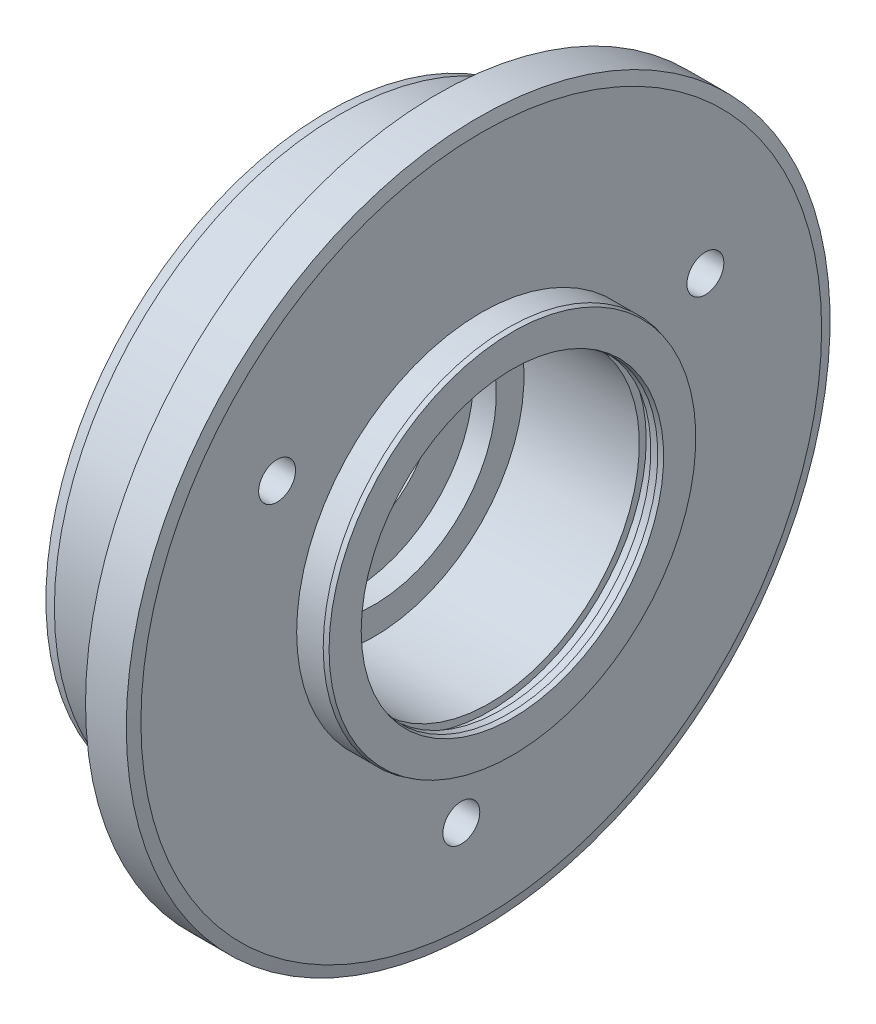
ISO-10303-21;
HEADER;
FILE_DESCRIPTION(('STEP AP214'),'2;1');
FILE_NAME('part.step','',(''),(''),'','','');
FILE_SCHEMA(('AUTOMOTIVE_DESIGN { 1 0 10303 214 1 1 1 1 }'));
ENDSEC;
DATA;
#1=APPLICATION_CONTEXT('core data for automotive mechanical design processes');
#2=APPLICATION_PROTOCOL_DEFINITION('international standard','automotive_design',2000,#1);
#3=PRODUCT_CONTEXT('',#1,'mechanical');
#4=PRODUCT('Part','Part','',(#3));
#5=PRODUCT_RELATED_PRODUCT_CATEGORY('part','',(#4));
#6=PRODUCT_DEFINITION_FORMATION('','',#4);
#7=PRODUCT_DEFINITION_CONTEXT('part definition',#1,'design');
#8=PRODUCT_DEFINITION('design','',#6,#7);
#9=PRODUCT_DEFINITION_SHAPE('','',#8);
#10=(LENGTH_UNIT() NAMED_UNIT(*) SI_UNIT(.MILLI.,.METRE.));
#11=(NAMED_UNIT(*) PLANE_ANGLE_UNIT() SI_UNIT($,.RADIAN.));
#12=(NAMED_UNIT(*) SI_UNIT($,.STERADIAN.) SOLID_ANGLE_UNIT());
#13=UNCERTAINTY_MEASURE_WITH_UNIT(LENGTH_MEASURE(1.E-05),#10,'distance_accuracy_value','');
#14=(GEOMETRIC_REPRESENTATION_CONTEXT(3) GLOBAL_UNCERTAINTY_ASSIGNED_CONTEXT((#13)) GLOBAL_UNIT_ASSIGNED_CONTEXT((#10,
#11,#12)) REPRESENTATION_CONTEXT('',''));
#15=CARTESIAN_POINT('',(0.,0.,0.));
#16=DIRECTION('',(0.,0.,1.));
#17=DIRECTION('',(1.,0.,0.));
#18=AXIS2_PLACEMENT_3D('',#15,#16,#17);
#19=CARTESIAN_POINT('',(0.,0.,0.));
#20=DIRECTION('',(-1.,0.,0.));
#21=DIRECTION('',(0.,0.,1.));
#22=AXIS2_PLACEMENT_3D('',#19,#20,#21);
#23=CYLINDRICAL_SURFACE('',#22,12.35);
#24=CARTESIAN_POINT('',(0.500000000000001,0.,0.));
#25=DIRECTION('',(1.,0.,0.));
#26=DIRECTION('',(0.,0.,-1.));
#27=AXIS2_PLACEMENT_3D('',#24,#25,#26);
#28=CIRCLE('',#27,12.35);
#29=CARTESIAN_POINT('',(0.500000000000001,0.,-12.35));
#30=VERTEX_POINT('',#29);
#31=EDGE_CURVE('E11',#30,#30,#28,.T.);
#32=ORIENTED_EDGE('',*,*,#31,.T.);
#33=EDGE_LOOP('',(#32));
#34=FACE_BOUND('',#33,.T.);
#35=CARTESIAN_POINT('',(4.75,0.,0.));
#36=DIRECTION('',(-1.,0.,0.));
#37=DIRECTION('',(0.,0.,1.));
#38=AXIS2_PLACEMENT_3D('',#35,#36,#37);
#39=CIRCLE('',#38,12.35);
#40=CARTESIAN_POINT('',(4.75,0.,12.35));
#41=VERTEX_POINT('',#40);
#42=EDGE_CURVE('E80',#41,#41,#39,.T.);
#43=ORIENTED_EDGE('',*,*,#42,.T.);
#44=EDGE_LOOP('',(#43));
#45=FACE_BOUND('',#44,.T.);
#46=ADVANCED_FACE('F37',(#34,#45),#23,.T.);
#47=CARTESIAN_POINT('',(0.,3.5,0.));
#48=DIRECTION('',(1.,0.,0.));
#49=DIRECTION('',(0.,0.,-1.));
#50=AXIS2_PLACEMENT_3D('',#47,#48,#49);
#51=PLANE('',#50);
#52=CARTESIAN_POINT('',(0.,0.,0.));
#53=DIRECTION('',(1.,0.,0.));
#54=DIRECTION('',(0.,0.,-1.));
#55=AXIS2_PLACEMENT_3D('',#52,#53,#54);
#56=CIRCLE('',#55,12.2160254037844);
#57=CARTESIAN_POINT('',(0.,0.,-12.2160254037844));
#58=VERTEX_POINT('',#57);
#59=EDGE_CURVE('E44',#58,#58,#56,.F.);
#60=ORIENTED_EDGE('',*,*,#59,.T.);
#61=EDGE_LOOP('',(#60));
#62=FACE_BOUND('',#61,.T.);
#63=CARTESIAN_POINT('',(0.,0.,0.));
#64=DIRECTION('',(-1.,0.,0.));
#65=DIRECTION('',(0.,0.,1.));
#66=AXIS2_PLACEMENT_3D('',#63,#64,#65);
#67=CIRCLE('',#66,3.5);
#68=CARTESIAN_POINT('',(0.,0.,3.5));
#69=VERTEX_POINT('',#68);
#70=EDGE_CURVE('E113',#69,#69,#67,.T.);
#71=ORIENTED_EDGE('',*,*,#70,.F.);
#72=EDGE_LOOP('',(#71));
#73=FACE_BOUND('',#72,.T.);
#74=ADVANCED_FACE('F136',(#62,#73),#51,.F.);
#75=CARTESIAN_POINT('',(0.,0.,0.));
#76=DIRECTION('',(-1.,0.,0.));
#77=DIRECTION('',(0.,0.,1.));
#78=AXIS2_PLACEMENT_3D('',#75,#76,#77);
#79=CYLINDRICAL_SURFACE('',#78,3.5);
#80=CARTESIAN_POINT('',(1.,0.,0.));
#81=DIRECTION('',(-1.,0.,0.));
#82=DIRECTION('',(0.,0.,1.));
#83=AXIS2_PLACEMENT_3D('',#80,#81,#82);
#84=CIRCLE('',#83,3.5);
#85=CARTESIAN_POINT('',(1.,0.,3.5));
#86=VERTEX_POINT('',#85);
#87=EDGE_CURVE('E110',#86,#86,#84,.T.);
#88=ORIENTED_EDGE('',*,*,#87,.F.);
#89=EDGE_LOOP('',(#88));
#90=FACE_BOUND('',#89,.T.);
#91=ORIENTED_EDGE('',*,*,#70,.T.);
#92=EDGE_LOOP('',(#91));
#93=FACE_BOUND('',#92,.T.);
#94=ADVANCED_FACE('F161',(#90,#93),#79,.F.);
#95=CARTESIAN_POINT('',(1.,5.305,0.));
#96=DIRECTION('',(-1.,0.,0.));
#97=DIRECTION('',(0.,0.,1.));
#98=AXIS2_PLACEMENT_3D('',#95,#96,#97);
#99=PLANE('',#98);
#100=CARTESIAN_POINT('',(1.,0.,0.));
#101=DIRECTION('',(-1.,0.,0.));
#102=DIRECTION('',(0.,0.,1.));
#103=AXIS2_PLACEMENT_3D('',#100,#101,#102);
#104=CIRCLE('',#103,5.305);
#105=CARTESIAN_POINT('',(1.,0.,5.305));
#106=VERTEX_POINT('',#105);
#107=EDGE_CURVE('E107',#106,#106,#104,.T.);
#108=ORIENTED_EDGE('',*,*,#107,.F.);
#109=EDGE_LOOP('',(#108));
#110=FACE_BOUND('',#109,.T.);
#111=ORIENTED_EDGE('',*,*,#87,.T.);
#112=EDGE_LOOP('',(#111));
#113=FACE_BOUND('',#112,.T.);
#114=ADVANCED_FACE('F219',(#110,#113),#99,.F.);
#115=CARTESIAN_POINT('',(0.,0.,0.));
#116=DIRECTION('',(-1.,0.,0.));
#117=DIRECTION('',(0.,0.,1.));
#118=AXIS2_PLACEMENT_3D('',#115,#116,#117);
#119=CYLINDRICAL_SURFACE('',#118,5.305);
#120=CARTESIAN_POINT('',(2.,0.,0.));
#121=DIRECTION('',(-1.,0.,0.));
#122=DIRECTION('',(0.,0.,1.));
#123=AXIS2_PLACEMENT_3D('',#120,#121,#122);
#124=CIRCLE('',#123,5.305);
#125=CARTESIAN_POINT('',(2.,0.,5.305));
#126=VERTEX_POINT('',#125);
#127=EDGE_CURVE('E104',#126,#126,#124,.T.);
#128=ORIENTED_EDGE('',*,*,#127,.F.);
#129=EDGE_LOOP('',(#128));
#130=FACE_BOUND('',#129,.T.);
#131=ORIENTED_EDGE('',*,*,#107,.T.);
#132=EDGE_LOOP('',(#131));
#133=FACE_BOUND('',#132,.T.);
#134=ADVANCED_FACE('F215',(#130,#133),#119,.F.);
#135=CARTESIAN_POINT('',(2.,6.5,0.));
#136=DIRECTION('',(-1.,0.,0.));
#137=DIRECTION('',(0.,0.,1.));
#138=AXIS2_PLACEMENT_3D('',#135,#136,#137);
#139=PLANE('',#138);
#140=CARTESIAN_POINT('',(2.,0.,0.));
#141=DIRECTION('',(-1.,0.,0.));
#142=DIRECTION('',(0.,0.,1.));
#143=AXIS2_PLACEMENT_3D('',#140,#141,#142);
#144=CIRCLE('',#143,6.5);
#145=CARTESIAN_POINT('',(2.,0.,6.5));
#146=VERTEX_POINT('',#145);
#147=EDGE_CURVE('E101',#146,#146,#144,.T.);
#148=ORIENTED_EDGE('',*,*,#147,.F.);
#149=EDGE_LOOP('',(#148));
#150=FACE_BOUND('',#149,.T.);
#151=ORIENTED_EDGE('',*,*,#127,.T.);
#152=EDGE_LOOP('',(#151));
#153=FACE_BOUND('',#152,.T.);
#154=ADVANCED_FACE('F211',(#150,#153),#139,.F.);
#155=CARTESIAN_POINT('',(0.,0.,0.));
#156=DIRECTION('',(-1.,0.,0.));
#157=DIRECTION('',(0.,0.,1.));
#158=AXIS2_PLACEMENT_3D('',#155,#156,#157);
#159=CYLINDRICAL_SURFACE('',#158,6.5);
#160=CARTESIAN_POINT('',(7.,0.,0.));
#161=DIRECTION('',(-1.,0.,0.));
#162=DIRECTION('',(0.,0.,1.));
#163=AXIS2_PLACEMENT_3D('',#160,#161,#162);
#164=CIRCLE('',#163,6.5);
#165=CARTESIAN_POINT('',(7.,0.,6.5));
#166=VERTEX_POINT('',#165);
#167=EDGE_CURVE('E98',#166,#166,#164,.T.);
#168=ORIENTED_EDGE('',*,*,#167,.F.);
#169=EDGE_LOOP('',(#168));
#170=FACE_BOUND('',#169,.T.);
#171=ORIENTED_EDGE('',*,*,#147,.T.);
#172=EDGE_LOOP('',(#171));
#173=FACE_BOUND('',#172,.T.);
#174=ADVANCED_FACE('F207',(#170,#173),#159,.F.);
#175=CARTESIAN_POINT('',(7.,6.8,0.));
#176=DIRECTION('',(-1.,0.,0.));
#177=DIRECTION('',(0.,0.,1.));
#178=AXIS2_PLACEMENT_3D('',#175,#176,#177);
#179=PLANE('',#178);
#180=CARTESIAN_POINT('',(7.,0.,0.));
#181=DIRECTION('',(-1.,0.,0.));
#182=DIRECTION('',(0.,0.,1.));
#183=AXIS2_PLACEMENT_3D('',#180,#181,#182);
#184=CIRCLE('',#183,6.8);
#185=CARTESIAN_POINT('',(7.,0.,6.8));
#186=VERTEX_POINT('',#185);
#187=EDGE_CURVE('E95',#186,#186,#184,.T.);
#188=ORIENTED_EDGE('',*,*,#187,.F.);
#189=EDGE_LOOP('',(#188));
#190=FACE_BOUND('',#189,.T.);
#191=ORIENTED_EDGE('',*,*,#167,.T.);
#192=EDGE_LOOP('',(#191));
#193=FACE_BOUND('',#192,.T.);
#194=ADVANCED_FACE('F203',(#190,#193),#179,.F.);
#195=CARTESIAN_POINT('',(0.,0.,0.));
#196=DIRECTION('',(-1.,0.,0.));
#197=DIRECTION('',(0.,0.,1.));
#198=AXIS2_PLACEMENT_3D('',#195,#196,#197);
#199=CYLINDRICAL_SURFACE('',#198,6.8);
#200=CARTESIAN_POINT('',(7.5,0.,0.));
#201=DIRECTION('',(-1.,0.,0.));
#202=DIRECTION('',(0.,0.,1.));
#203=AXIS2_PLACEMENT_3D('',#200,#201,#202);
#204=CIRCLE('',#203,6.8);
#205=CARTESIAN_POINT('',(7.5,0.,6.8));
#206=VERTEX_POINT('',#205);
#207=EDGE_CURVE('E92',#206,#206,#204,.T.);
#208=ORIENTED_EDGE('',*,*,#207,.F.);
#209=EDGE_LOOP('',(#208));
#210=FACE_BOUND('',#209,.T.);
#211=ORIENTED_EDGE('',*,*,#187,.T.);
#212=EDGE_LOOP('',(#211));
#213=FACE_BOUND('',#212,.T.);
#214=ADVANCED_FACE('F199',(#210,#213),#199,.F.);
#215=CARTESIAN_POINT('',(7.5,6.5,0.));
#216=DIRECTION('',(1.,0.,0.));
#217=DIRECTION('',(0.,0.,-1.));
#218=AXIS2_PLACEMENT_3D('',#215,#216,#217);
#219=PLANE('',#218);
#220=CARTESIAN_POINT('',(7.5,0.,0.));
#221=DIRECTION('',(-1.,0.,0.));
#222=DIRECTION('',(0.,0.,1.));
#223=AXIS2_PLACEMENT_3D('',#220,#221,#222);
#224=CIRCLE('',#223,6.5);
#225=CARTESIAN_POINT('',(7.5,0.,6.5));
#226=VERTEX_POINT('',#225);
#227=EDGE_CURVE('E89',#226,#226,#224,.T.);
#228=ORIENTED_EDGE('',*,*,#227,.F.);
#229=EDGE_LOOP('',(#228));
#230=FACE_BOUND('',#229,.T.);
#231=ORIENTED_EDGE('',*,*,#207,.T.);
#232=EDGE_LOOP('',(#231));
#233=FACE_BOUND('',#232,.T.);
#234=ADVANCED_FACE('F195',(#230,#233),#219,.F.);
#235=CARTESIAN_POINT('',(0.,0.,0.));
#236=DIRECTION('',(-1.,0.,0.));
#237=DIRECTION('',(0.,0.,1.));
#238=AXIS2_PLACEMENT_3D('',#235,#236,#237);
#239=CYLINDRICAL_SURFACE('',#238,6.5);
#240=CARTESIAN_POINT('',(7.8,0.,0.));
#241=DIRECTION('',(-1.,0.,0.));
#242=DIRECTION('',(0.,0.,1.));
#243=AXIS2_PLACEMENT_3D('',#240,#241,#242);
#244=CIRCLE('',#243,6.5);
#245=CARTESIAN_POINT('',(7.8,0.,6.5));
#246=VERTEX_POINT('',#245);
#247=EDGE_CURVE('E131',#246,#246,#244,.F.);
#248=ORIENTED_EDGE('',*,*,#247,.T.);
#249=EDGE_LOOP('',(#248));
#250=FACE_BOUND('',#249,.T.);
#251=ORIENTED_EDGE('',*,*,#227,.T.);
#252=EDGE_LOOP('',(#251));
#253=FACE_BOUND('',#252,.T.);
#254=ADVANCED_FACE('F191',(#250,#253),#239,.F.);
#255=CARTESIAN_POINT('',(8.,8.,0.));
#256=DIRECTION('',(-1.,0.,0.));
#257=DIRECTION('',(0.,0.,1.));
#258=AXIS2_PLACEMENT_3D('',#255,#256,#257);
#259=PLANE('',#258);
#260=CARTESIAN_POINT('',(8.,0.,0.));
#261=DIRECTION('',(-1.,0.,0.));
#262=DIRECTION('',(0.,0.,1.));
#263=AXIS2_PLACEMENT_3D('',#260,#261,#262);
#264=CIRCLE('',#263,7.94641016151377);
#265=CARTESIAN_POINT('',(8.,0.,7.94641016151377));
#266=VERTEX_POINT('',#265);
#267=EDGE_CURVE('E128',#266,#266,#264,.F.);
#268=ORIENTED_EDGE('',*,*,#267,.T.);
#269=EDGE_LOOP('',(#268));
#270=FACE_BOUND('',#269,.T.);
#271=CARTESIAN_POINT('',(8.,0.,0.));
#272=DIRECTION('',(-1.,0.,0.));
#273=DIRECTION('',(0.,0.,1.));
#274=AXIS2_PLACEMENT_3D('',#271,#272,#273);
#275=CIRCLE('',#274,6.55358983848623);
#276=CARTESIAN_POINT('',(8.,0.,6.55358983848623));
#277=VERTEX_POINT('',#276);
#278=EDGE_CURVE('E125',#277,#277,#275,.T.);
#279=ORIENTED_EDGE('',*,*,#278,.T.);
#280=EDGE_LOOP('',(#279));
#281=FACE_BOUND('',#280,.T.);
#282=ADVANCED_FACE('F187',(#270,#281),#259,.F.);
#283=CARTESIAN_POINT('',(0.,0.,0.));
#284=DIRECTION('',(-1.,0.,0.));
#285=DIRECTION('',(0.,0.,1.));
#286=AXIS2_PLACEMENT_3D('',#283,#284,#285);
#287=CYLINDRICAL_SURFACE('',#286,8.);
#288=CARTESIAN_POINT('',(7.8,0.,0.));
#289=DIRECTION('',(-1.,0.,0.));
#290=DIRECTION('',(0.,0.,1.));
#291=AXIS2_PLACEMENT_3D('',#288,#289,#290);
#292=CIRCLE('',#291,8.);
#293=CARTESIAN_POINT('',(7.8,0.,8.));
#294=VERTEX_POINT('',#293);
#295=EDGE_CURVE('E122',#294,#294,#292,.T.);
#296=ORIENTED_EDGE('',*,*,#295,.T.);
#297=EDGE_LOOP('',(#296));
#298=FACE_BOUND('',#297,.T.);
#299=CARTESIAN_POINT('',(6.65000000000001,0.,0.));
#300=DIRECTION('',(-1.,0.,0.));
#301=DIRECTION('',(0.,0.,1.));
#302=AXIS2_PLACEMENT_3D('',#299,#300,#301);
#303=CIRCLE('',#302,8.);
#304=CARTESIAN_POINT('',(6.65000000000001,0.,8.));
#305=VERTEX_POINT('',#304);
#306=EDGE_CURVE('E86',#305,#305,#303,.T.);
#307=ORIENTED_EDGE('',*,*,#306,.F.);
#308=EDGE_LOOP('',(#307));
#309=FACE_BOUND('',#308,.T.);
#310=ADVANCED_FACE('F180',(#298,#309),#287,.T.);
#311=CARTESIAN_POINT('',(6.65,15.25,0.));
#312=DIRECTION('',(-1.,0.,0.));
#313=DIRECTION('',(0.,0.,1.));
#314=AXIS2_PLACEMENT_3D('',#311,#312,#313);
#315=PLANE('',#314);
#316=CARTESIAN_POINT('',(6.65,-10.7151904779963,0.864403274089921));
#317=DIRECTION('',(1.,0.,0.));
#318=DIRECTION('',(0.,0.,-1.));
#319=AXIS2_PLACEMENT_3D('',#316,#317,#318);
#320=CIRCLE('',#319,0.799999999999995);
#321=CARTESIAN_POINT('',(6.65,-10.7151904779963,0.0644032740899263));
#322=VERTEX_POINT('',#321);
#323=EDGE_CURVE('E63',#322,#322,#320,.T.);
#324=ORIENTED_EDGE('',*,*,#323,.F.);
#325=EDGE_LOOP('',(#324));
#326=FACE_BOUND('',#325,.T.);
#327=CARTESIAN_POINT('',(6.65,6.10619043347451,8.84742552328893));
#328=DIRECTION('',(1.,0.,0.));
#329=DIRECTION('',(0.,0.,-1.));
#330=AXIS2_PLACEMENT_3D('',#327,#328,#329);
#331=CIRCLE('',#330,0.799999999999995);
#332=CARTESIAN_POINT('',(6.65,6.10619043347451,8.04742552328893));
#333=VERTEX_POINT('',#332);
#334=EDGE_CURVE('E71',#333,#333,#331,.T.);
#335=ORIENTED_EDGE('',*,*,#334,.F.);
#336=EDGE_LOOP('',(#335));
#337=FACE_BOUND('',#336,.T.);
#338=CARTESIAN_POINT('',(6.65,4.60900004452175,-9.71182879737892));
#339=DIRECTION('',(1.,0.,0.));
#340=DIRECTION('',(0.,0.,-1.));
#341=AXIS2_PLACEMENT_3D('',#338,#339,#340);
#342=CIRCLE('',#341,0.799999999999996);
#343=CARTESIAN_POINT('',(6.65,4.60900004452175,-10.5118287973789));
#344=VERTEX_POINT('',#343);
#345=EDGE_CURVE('E77',#344,#344,#342,.T.);
#346=ORIENTED_EDGE('',*,*,#345,.F.);
#347=EDGE_LOOP('',(#346));
#348=FACE_BOUND('',#347,.T.);
#349=CARTESIAN_POINT('',(6.65,0.,0.));
#350=DIRECTION('',(-1.,0.,0.));
#351=DIRECTION('',(0.,0.,1.));
#352=AXIS2_PLACEMENT_3D('',#349,#350,#351);
#353=CIRCLE('',#352,14.75);
#354=CARTESIAN_POINT('',(6.65,0.,14.75));
#355=VERTEX_POINT('',#354);
#356=EDGE_CURVE('E119',#355,#355,#353,.F.);
#357=ORIENTED_EDGE('',*,*,#356,.T.);
#358=EDGE_LOOP('',(#357));
#359=FACE_BOUND('',#358,.T.);
#360=ORIENTED_EDGE('',*,*,#306,.T.);
#361=EDGE_LOOP('',(#360));
#362=FACE_BOUND('',#361,.T.);
#363=ADVANCED_FACE('F174',(#326,#337,#348,#359,#362),#315,.F.);
#364=CARTESIAN_POINT('',(0.,0.,0.));
#365=DIRECTION('',(-1.,0.,0.));
#366=DIRECTION('',(0.,0.,1.));
#367=AXIS2_PLACEMENT_3D('',#364,#365,#366);
#368=CYLINDRICAL_SURFACE('',#367,15.25);
#369=CARTESIAN_POINT('',(6.51602540378444,0.,0.));
#370=DIRECTION('',(-1.,0.,0.));
#371=DIRECTION('',(0.,0.,1.));
#372=AXIS2_PLACEMENT_3D('',#369,#370,#371);
#373=CIRCLE('',#372,15.25);
#374=CARTESIAN_POINT('',(6.51602540378444,0.,15.25));
#375=VERTEX_POINT('',#374);
#376=EDGE_CURVE('E116',#375,#375,#373,.T.);
#377=ORIENTED_EDGE('',*,*,#376,.T.);
#378=EDGE_LOOP('',(#377));
#379=FACE_BOUND('',#378,.T.);
#380=CARTESIAN_POINT('',(4.75,0.,0.));
#381=DIRECTION('',(-1.,0.,0.));
#382=DIRECTION('',(0.,0.,1.));
#383=AXIS2_PLACEMENT_3D('',#380,#381,#382);
#384=CIRCLE('',#383,15.25);
#385=CARTESIAN_POINT('',(4.75,0.,15.25));
#386=VERTEX_POINT('',#385);
#387=EDGE_CURVE('E83',#386,#386,#384,.T.);
#388=ORIENTED_EDGE('',*,*,#387,.F.);
#389=EDGE_LOOP('',(#388));
#390=FACE_BOUND('',#389,.T.);
#391=ADVANCED_FACE('F169',(#379,#390),#368,.T.);
#392=CARTESIAN_POINT('',(4.75,12.35,0.));
#393=DIRECTION('',(1.,0.,0.));
#394=DIRECTION('',(0.,0.,-1.));
#395=AXIS2_PLACEMENT_3D('',#392,#393,#394);
#396=PLANE('',#395);
#397=ORIENTED_EDGE('',*,*,#42,.F.);
#398=EDGE_LOOP('',(#397));
#399=FACE_BOUND('',#398,.T.);
#400=ORIENTED_EDGE('',*,*,#387,.T.);
#401=EDGE_LOOP('',(#400));
#402=FACE_BOUND('',#401,.T.);
#403=ADVANCED_FACE('F165',(#399,#402),#396,.F.);
#404=CARTESIAN_POINT('',(6.51602540378444,0.,0.));
#405=DIRECTION('',(-1.,0.,0.));
#406=DIRECTION('',(0.,0.,1.));
#407=AXIS2_PLACEMENT_3D('',#404,#405,#406);
#408=CONICAL_SURFACE('',#407,15.25,1.30899693899575);
#409=ORIENTED_EDGE('',*,*,#356,.F.);
#410=EDGE_LOOP('',(#409));
#411=FACE_BOUND('',#410,.T.);
#412=ORIENTED_EDGE('',*,*,#376,.F.);
#413=EDGE_LOOP('',(#412));
#414=FACE_BOUND('',#413,.T.);
#415=ADVANCED_FACE('F168',(#411,#414),#408,.T.);
#416=CARTESIAN_POINT('',(7.8,0.,0.));
#417=DIRECTION('',(-1.,0.,0.));
#418=DIRECTION('',(0.,0.,1.));
#419=AXIS2_PLACEMENT_3D('',#416,#417,#418);
#420=CONICAL_SURFACE('',#419,8.,0.261799387799157);
#421=ORIENTED_EDGE('',*,*,#267,.F.);
#422=EDGE_LOOP('',(#421));
#423=FACE_BOUND('',#422,.T.);
#424=ORIENTED_EDGE('',*,*,#295,.F.);
#425=EDGE_LOOP('',(#424));
#426=FACE_BOUND('',#425,.T.);
#427=ADVANCED_FACE('F152',(#423,#426),#420,.T.);
#428=CARTESIAN_POINT('',(8.,0.,0.));
#429=DIRECTION('',(1.,0.,0.));
#430=DIRECTION('',(0.,0.,-1.));
#431=AXIS2_PLACEMENT_3D('',#428,#429,#430);
#432=CONICAL_SURFACE('',#431,6.55358983848623,0.261799387799157);
#433=ORIENTED_EDGE('',*,*,#247,.F.);
#434=EDGE_LOOP('',(#433));
#435=FACE_BOUND('',#434,.T.);
#436=ORIENTED_EDGE('',*,*,#278,.F.);
#437=EDGE_LOOP('',(#436));
#438=FACE_BOUND('',#437,.T.);
#439=ADVANCED_FACE('F142',(#435,#438),#432,.F.);
#440=CARTESIAN_POINT('',(0.,0.,0.));
#441=DIRECTION('',(1.,0.,0.));
#442=DIRECTION('',(0.,0.,-1.));
#443=AXIS2_PLACEMENT_3D('',#440,#441,#442);
#444=CONICAL_SURFACE('',#443,12.2160254037844,0.261799387799156);
#445=ORIENTED_EDGE('',*,*,#31,.F.);
#446=EDGE_LOOP('',(#445));
#447=FACE_BOUND('',#446,.T.);
#448=ORIENTED_EDGE('',*,*,#59,.F.);
#449=EDGE_LOOP('',(#448));
#450=FACE_BOUND('',#449,.T.);
#451=ADVANCED_FACE('F139',(#447,#450),#444,.T.);
#452=CARTESIAN_POINT('',(6.65,4.60900004452175,-9.71182879737892));
#453=DIRECTION('',(1.,0.,0.));
#454=DIRECTION('',(0.,0.,-1.));
#455=AXIS2_PLACEMENT_3D('',#452,#453,#454);
#456=CYLINDRICAL_SURFACE('',#455,0.799999999999997);
#457=CARTESIAN_POINT('',(1.15,4.60900004452175,-9.71182879737892));
#458=DIRECTION('',(1.,0.,0.));
#459=DIRECTION('',(0.,0.,-1.));
#460=AXIS2_PLACEMENT_3D('',#457,#458,#459);
#461=CIRCLE('',#460,0.799999999999999);
#462=CARTESIAN_POINT('',(1.15,4.60900004452175,-10.5118287973789));
#463=VERTEX_POINT('',#462);
#464=EDGE_CURVE('E74',#463,#463,#461,.T.);
#465=ORIENTED_EDGE('',*,*,#464,.F.);
#466=EDGE_LOOP('',(#465));
#467=FACE_BOUND('',#466,.T.);
#468=ORIENTED_EDGE('',*,*,#345,.T.);
#469=EDGE_LOOP('',(#468));
#470=FACE_BOUND('',#469,.T.);
#471=ADVANCED_FACE('F141',(#467,#470),#456,.F.);
#472=CARTESIAN_POINT('',(1.15,4.60900004452175,-9.71182879737892));
#473=DIRECTION('',(1.,0.,0.));
#474=DIRECTION('',(0.,0.,-1.));
#475=AXIS2_PLACEMENT_3D('',#472,#473,#474);
#476=CONICAL_SURFACE('',#475,0.799999999999999,1.02974425867665);
#477=CARTESIAN_POINT('',(0.669311504777951,4.60900004452174,-9.71182879737892));
#478=VERTEX_POINT('',#477);
#479=VERTEX_LOOP('',#478);
#480=FACE_BOUND('',#479,.T.);
#481=ORIENTED_EDGE('',*,*,#464,.T.);
#482=EDGE_LOOP('',(#481));
#483=FACE_BOUND('',#482,.T.);
#484=ADVANCED_FACE('F149',(#480,#483),#476,.F.);
#485=CARTESIAN_POINT('',(6.65,6.10619043347451,8.84742552328893));
#486=DIRECTION('',(1.,0.,0.));
#487=DIRECTION('',(0.,0.,-1.));
#488=AXIS2_PLACEMENT_3D('',#485,#486,#487);
#489=CYLINDRICAL_SURFACE('',#488,0.799999999999997);
#490=CARTESIAN_POINT('',(1.15,6.10619043347451,8.84742552328893));
#491=DIRECTION('',(1.,0.,0.));
#492=DIRECTION('',(0.,0.,-1.));
#493=AXIS2_PLACEMENT_3D('',#490,#491,#492);
#494=CIRCLE('',#493,0.799999999999999);
#495=CARTESIAN_POINT('',(1.15,6.10619043347451,8.04742552328893));
#496=VERTEX_POINT('',#495);
#497=EDGE_CURVE('E66',#496,#496,#494,.T.);
#498=ORIENTED_EDGE('',*,*,#497,.F.);
#499=EDGE_LOOP('',(#498));
#500=FACE_BOUND('',#499,.T.);
#501=ORIENTED_EDGE('',*,*,#334,.T.);
#502=EDGE_LOOP('',(#501));
#503=FACE_BOUND('',#502,.T.);
#504=ADVANCED_FACE('F331',(#500,#503),#489,.F.);
#505=CARTESIAN_POINT('',(1.15,6.10619043347451,8.84742552328893));
#506=DIRECTION('',(1.,0.,0.));
#507=DIRECTION('',(0.,0.,-1.));
#508=AXIS2_PLACEMENT_3D('',#505,#506,#507);
#509=CONICAL_SURFACE('',#508,0.799999999999999,1.02974425867665);
#510=CARTESIAN_POINT('',(0.669311504777951,6.10619043347451,8.84742552328893));
#511=VERTEX_POINT('',#510);
#512=VERTEX_LOOP('',#511);
#513=FACE_BOUND('',#512,.T.);
#514=ORIENTED_EDGE('',*,*,#497,.T.);
#515=EDGE_LOOP('',(#514));
#516=FACE_BOUND('',#515,.T.);
#517=ADVANCED_FACE('F340',(#513,#516),#509,.F.);
#518=CARTESIAN_POINT('',(6.65,-10.7151904779963,0.864403274089921));
#519=DIRECTION('',(1.,0.,0.));
#520=DIRECTION('',(0.,0.,-1.));
#521=AXIS2_PLACEMENT_3D('',#518,#519,#520);
#522=CYLINDRICAL_SURFACE('',#521,0.799999999999997);
#523=CARTESIAN_POINT('',(1.15,-10.7151904779963,0.864403274089921));
#524=DIRECTION('',(1.,0.,0.));
#525=DIRECTION('',(0.,0.,-1.));
#526=AXIS2_PLACEMENT_3D('',#523,#524,#525);
#527=CIRCLE('',#526,0.799999999999999);
#528=CARTESIAN_POINT('',(1.15,-10.7151904779963,0.0644032740899228));
#529=VERTEX_POINT('',#528);
#530=EDGE_CURVE('E61',#529,#529,#527,.T.);
#531=ORIENTED_EDGE('',*,*,#530,.F.);
#532=EDGE_LOOP('',(#531));
#533=FACE_BOUND('',#532,.T.);
#534=ORIENTED_EDGE('',*,*,#323,.T.);
#535=EDGE_LOOP('',(#534));
#536=FACE_BOUND('',#535,.T.);
#537=ADVANCED_FACE('F57',(#533,#536),#522,.F.);
#538=CARTESIAN_POINT('',(1.15,-10.7151904779963,0.864403274089921));
#539=DIRECTION('',(1.,0.,0.));
#540=DIRECTION('',(0.,0.,-1.));
#541=AXIS2_PLACEMENT_3D('',#538,#539,#540);
#542=CONICAL_SURFACE('',#541,0.799999999999999,1.02974425867665);
#543=CARTESIAN_POINT('',(0.669311504777951,-10.7151904779963,0.864403274089921));
#544=VERTEX_POINT('',#543);
#545=VERTEX_LOOP('',#544);
#546=FACE_BOUND('',#545,.T.);
#547=ORIENTED_EDGE('',*,*,#530,.T.);
#548=EDGE_LOOP('',(#547));
#549=FACE_BOUND('',#548,.T.);
#550=ADVANCED_FACE('F54',(#546,#549),#542,.F.);
#551=CLOSED_SHELL('',(#46,#74,#94,#114,#134,#154,#174,#194,#214,#234,#254,#282,#310,#363,#391,
#403,#415,#427,#439,#451,#471,#484,#504,#517,#537,#550));
#552=MANIFOLD_SOLID_BREP('B2',#551);
#553=ADVANCED_BREP_SHAPE_REPRESENTATION('',(#18,#552),#14);
#554=SHAPE_DEFINITION_REPRESENTATION(#9,#553);
ENDSEC;
END-ISO-10303-21;
